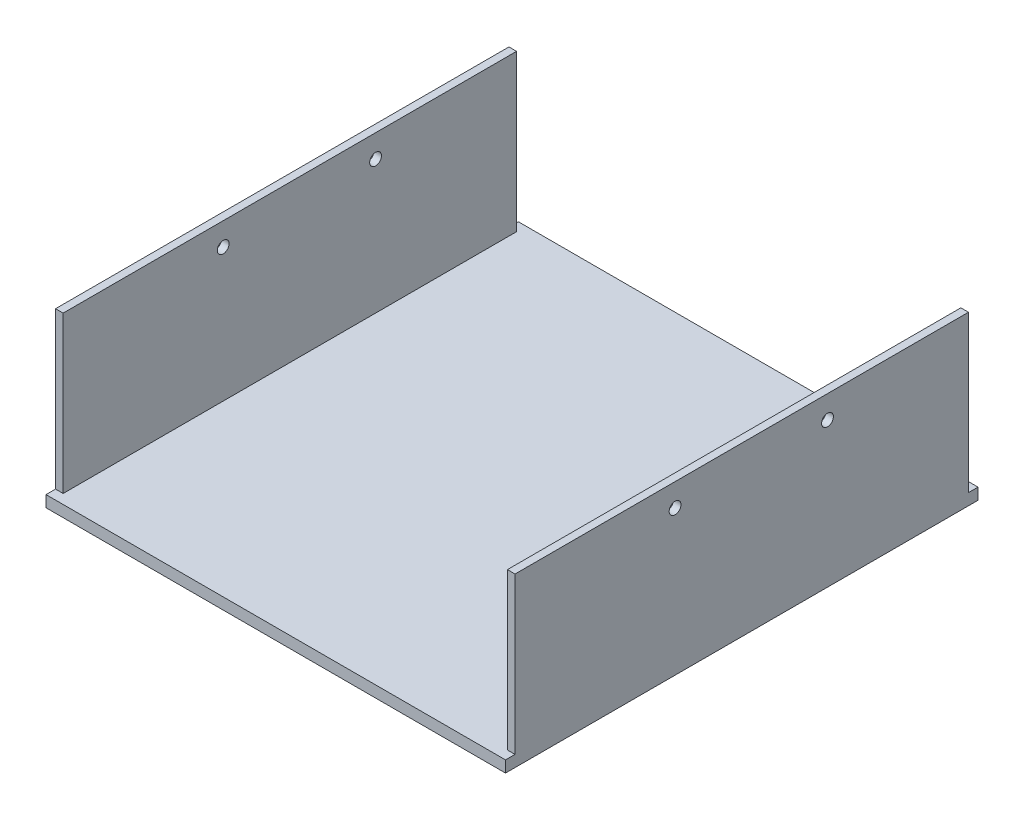
ISO-10303-21;
HEADER;
FILE_DESCRIPTION(('STEP AP214'),'2;1');
FILE_NAME('part.step','',(''),(''),'','','');
FILE_SCHEMA(('AUTOMOTIVE_DESIGN { 1 0 10303 214 1 1 1 1 }'));
ENDSEC;
DATA;
#1=APPLICATION_CONTEXT('core data for automotive mechanical design processes');
#2=APPLICATION_PROTOCOL_DEFINITION('international standard','automotive_design',2000,#1);
#3=PRODUCT_CONTEXT('',#1,'mechanical');
#4=PRODUCT('Part','Part','',(#3));
#5=PRODUCT_RELATED_PRODUCT_CATEGORY('part','',(#4));
#6=PRODUCT_DEFINITION_FORMATION('','',#4);
#7=PRODUCT_DEFINITION_CONTEXT('part definition',#1,'design');
#8=PRODUCT_DEFINITION('design','',#6,#7);
#9=PRODUCT_DEFINITION_SHAPE('','',#8);
#10=(LENGTH_UNIT() NAMED_UNIT(*) SI_UNIT(.MILLI.,.METRE.));
#11=(NAMED_UNIT(*) PLANE_ANGLE_UNIT() SI_UNIT($,.RADIAN.));
#12=(NAMED_UNIT(*) SI_UNIT($,.STERADIAN.) SOLID_ANGLE_UNIT());
#13=UNCERTAINTY_MEASURE_WITH_UNIT(LENGTH_MEASURE(1.E-05),#10,'distance_accuracy_value','');
#14=(GEOMETRIC_REPRESENTATION_CONTEXT(3) GLOBAL_UNCERTAINTY_ASSIGNED_CONTEXT((#13)) GLOBAL_UNIT_ASSIGNED_CONTEXT((#10,
#11,#12)) REPRESENTATION_CONTEXT('',''));
#15=CARTESIAN_POINT('',(0.,0.,0.));
#16=DIRECTION('',(0.,0.,1.));
#17=DIRECTION('',(1.,0.,0.));
#18=AXIS2_PLACEMENT_3D('',#15,#16,#17);
#19=CARTESIAN_POINT('',(0.,44.,0.));
#20=DIRECTION('',(0.,1.,0.));
#21=DIRECTION('',(0.,0.,1.));
#22=AXIS2_PLACEMENT_3D('',#19,#20,#21);
#23=PLANE('',#22);
#24=DIRECTION('',(0.,0.,1.));
#25=VECTOR('',#24,1.);
#26=CARTESIAN_POINT('',(-60.3,44.,-62.));
#27=LINE('',#26,#25);
#28=CARTESIAN_POINT('',(-60.3,44.,-59.5));
#29=VERTEX_POINT('',#28);
#30=CARTESIAN_POINT('',(-60.3,44.,59.5));
#31=VERTEX_POINT('',#30);
#32=EDGE_CURVE('E155',#29,#31,#27,.T.);
#33=ORIENTED_EDGE('',*,*,#32,.T.);
#34=DIRECTION('',(-1.,0.,0.));
#35=VECTOR('',#34,1.);
#36=CARTESIAN_POINT('',(-60.3,44.,59.5));
#37=LINE('',#36,#35);
#38=CARTESIAN_POINT('',(-58.3,44.,59.5));
#39=VERTEX_POINT('',#38);
#40=EDGE_CURVE('E149',#39,#31,#37,.T.);
#41=ORIENTED_EDGE('',*,*,#40,.F.);
#42=DIRECTION('',(0.,0.,1.));
#43=VECTOR('',#42,1.);
#44=CARTESIAN_POINT('',(-58.3,44.,-62.));
#45=LINE('',#44,#43);
#46=CARTESIAN_POINT('',(-58.3,44.,-59.5));
#47=VERTEX_POINT('',#46);
#48=EDGE_CURVE('E237',#47,#39,#45,.T.);
#49=ORIENTED_EDGE('',*,*,#48,.F.);
#50=DIRECTION('',(1.,0.,0.));
#51=VECTOR('',#50,1.);
#52=CARTESIAN_POINT('',(-60.3,44.,-59.5));
#53=LINE('',#52,#51);
#54=EDGE_CURVE('E217',#29,#47,#53,.T.);
#55=ORIENTED_EDGE('',*,*,#54,.F.);
#56=EDGE_LOOP('',(#33,#41,#49,#55));
#57=FACE_BOUND('',#56,.T.);
#58=ADVANCED_FACE('F38',(#57),#23,.T.);
#59=DIRECTION('',(0.,0.,-1.));
#60=VECTOR('',#59,1.);
#61=CARTESIAN_POINT('',(58.3,44.,62.));
#62=LINE('',#61,#60);
#63=CARTESIAN_POINT('',(58.3,44.,59.5));
#64=VERTEX_POINT('',#63);
#65=CARTESIAN_POINT('',(58.3,44.,-59.5));
#66=VERTEX_POINT('',#65);
#67=EDGE_CURVE('E148',#64,#66,#62,.T.);
#68=ORIENTED_EDGE('',*,*,#67,.F.);
#69=CARTESIAN_POINT('',(60.3,44.,59.5));
#70=VERTEX_POINT('',#69);
#71=EDGE_CURVE('E132',#70,#64,#37,.T.);
#72=ORIENTED_EDGE('',*,*,#71,.F.);
#73=DIRECTION('',(0.,0.,-1.));
#74=VECTOR('',#73,1.);
#75=CARTESIAN_POINT('',(60.3,44.,-62.));
#76=LINE('',#75,#74);
#77=CARTESIAN_POINT('',(60.3,44.,-59.5));
#78=VERTEX_POINT('',#77);
#79=EDGE_CURVE('E146',#70,#78,#76,.T.);
#80=ORIENTED_EDGE('',*,*,#79,.T.);
#81=EDGE_CURVE('E219',#66,#78,#53,.T.);
#82=ORIENTED_EDGE('',*,*,#81,.F.);
#83=EDGE_LOOP('',(#68,#72,#80,#82));
#84=FACE_BOUND('',#83,.T.);
#85=ADVANCED_FACE('F144',(#84),#23,.T.);
#86=CARTESIAN_POINT('',(60.3,44.,-62.));
#87=DIRECTION('',(-1.,0.,0.));
#88=DIRECTION('',(0.,0.,1.));
#89=AXIS2_PLACEMENT_3D('',#86,#87,#88);
#90=PLANE('',#89);
#91=CARTESIAN_POINT('',(60.3,38.,-22.5));
#92=DIRECTION('',(-1.,0.,0.));
#93=DIRECTION('',(0.,0.,1.));
#94=AXIS2_PLACEMENT_3D('',#91,#92,#93);
#95=CIRCLE('',#94,1.55);
#96=CARTESIAN_POINT('',(60.3,38.,-20.95));
#97=VERTEX_POINT('',#96);
#98=EDGE_CURVE('E182',#97,#97,#95,.T.);
#99=ORIENTED_EDGE('',*,*,#98,.T.);
#100=EDGE_LOOP('',(#99));
#101=FACE_BOUND('',#100,.T.);
#102=CARTESIAN_POINT('',(60.3,38.,17.5));
#103=DIRECTION('',(-1.,0.,0.));
#104=DIRECTION('',(0.,0.,1.));
#105=AXIS2_PLACEMENT_3D('',#102,#103,#104);
#106=CIRCLE('',#105,1.55);
#107=CARTESIAN_POINT('',(60.3,38.,19.05));
#108=VERTEX_POINT('',#107);
#109=EDGE_CURVE('E189',#108,#108,#106,.T.);
#110=ORIENTED_EDGE('',*,*,#109,.T.);
#111=EDGE_LOOP('',(#110));
#112=FACE_BOUND('',#111,.T.);
#113=DIRECTION('',(0.,-1.,0.));
#114=VECTOR('',#113,1.);
#115=CARTESIAN_POINT('',(60.3,44.,59.5));
#116=LINE('',#115,#114);
#117=CARTESIAN_POINT('',(60.3,3.,59.5));
#118=VERTEX_POINT('',#117);
#119=EDGE_CURVE('E129',#70,#118,#116,.T.);
#120=ORIENTED_EDGE('',*,*,#119,.T.);
#121=DIRECTION('',(0.,0.,-1.));
#122=VECTOR('',#121,1.);
#123=CARTESIAN_POINT('',(60.3,3.,59.5));
#124=LINE('',#123,#122);
#125=CARTESIAN_POINT('',(60.3,3.,62.));
#126=VERTEX_POINT('',#125);
#127=EDGE_CURVE('E206',#126,#118,#124,.T.);
#128=ORIENTED_EDGE('',*,*,#127,.F.);
#129=DIRECTION('',(0.,-1.,0.));
#130=VECTOR('',#129,1.);
#131=CARTESIAN_POINT('',(60.3,44.,62.));
#132=LINE('',#131,#130);
#133=CARTESIAN_POINT('',(60.3,0.,62.));
#134=VERTEX_POINT('',#133);
#135=EDGE_CURVE('E159',#126,#134,#132,.T.);
#136=ORIENTED_EDGE('',*,*,#135,.T.);
#137=DIRECTION('',(0.,0.,-1.));
#138=VECTOR('',#137,1.);
#139=CARTESIAN_POINT('',(60.3,0.,-62.));
#140=LINE('',#139,#138);
#141=CARTESIAN_POINT('',(60.3,0.,-62.));
#142=VERTEX_POINT('',#141);
#143=EDGE_CURVE('E168',#134,#142,#140,.T.);
#144=ORIENTED_EDGE('',*,*,#143,.T.);
#145=DIRECTION('',(0.,-1.,0.));
#146=VECTOR('',#145,1.);
#147=CARTESIAN_POINT('',(60.3,44.,-62.));
#148=LINE('',#147,#146);
#149=CARTESIAN_POINT('',(60.3,3.,-62.));
#150=VERTEX_POINT('',#149);
#151=EDGE_CURVE('E11',#150,#142,#148,.T.);
#152=ORIENTED_EDGE('',*,*,#151,.F.);
#153=DIRECTION('',(0.,0.,-1.));
#154=VECTOR('',#153,1.);
#155=CARTESIAN_POINT('',(60.3,3.,-59.5));
#156=LINE('',#155,#154);
#157=CARTESIAN_POINT('',(60.3,3.,-59.5));
#158=VERTEX_POINT('',#157);
#159=EDGE_CURVE('E223',#158,#150,#156,.T.);
#160=ORIENTED_EDGE('',*,*,#159,.F.);
#161=DIRECTION('',(0.,-1.,0.));
#162=VECTOR('',#161,1.);
#163=CARTESIAN_POINT('',(60.3,44.,-59.5));
#164=LINE('',#163,#162);
#165=EDGE_CURVE('E154',#78,#158,#164,.T.);
#166=ORIENTED_EDGE('',*,*,#165,.F.);
#167=ORIENTED_EDGE('',*,*,#79,.F.);
#168=EDGE_LOOP('',(#120,#128,#136,#144,#152,#160,#166,#167));
#169=FACE_BOUND('',#168,.T.);
#170=ADVANCED_FACE('F40',(#101,#112,#169),#90,.F.);
#171=CARTESIAN_POINT('',(-60.3,44.,-62.));
#172=DIRECTION('',(1.,0.,0.));
#173=DIRECTION('',(0.,0.,-1.));
#174=AXIS2_PLACEMENT_3D('',#171,#172,#173);
#175=PLANE('',#174);
#176=CARTESIAN_POINT('',(-60.3,38.,-22.5));
#177=DIRECTION('',(1.,0.,0.));
#178=DIRECTION('',(0.,0.,-1.));
#179=AXIS2_PLACEMENT_3D('',#176,#177,#178);
#180=CIRCLE('',#179,1.55);
#181=CARTESIAN_POINT('',(-60.3,38.,-24.05));
#182=VERTEX_POINT('',#181);
#183=EDGE_CURVE('E201',#182,#182,#180,.T.);
#184=ORIENTED_EDGE('',*,*,#183,.T.);
#185=EDGE_LOOP('',(#184));
#186=FACE_BOUND('',#185,.T.);
#187=CARTESIAN_POINT('',(-60.3,38.,17.5));
#188=DIRECTION('',(1.,0.,0.));
#189=DIRECTION('',(0.,0.,-1.));
#190=AXIS2_PLACEMENT_3D('',#187,#188,#189);
#191=CIRCLE('',#190,1.55);
#192=CARTESIAN_POINT('',(-60.3,38.,15.95));
#193=VERTEX_POINT('',#192);
#194=EDGE_CURVE('E186',#193,#193,#191,.T.);
#195=ORIENTED_EDGE('',*,*,#194,.T.);
#196=EDGE_LOOP('',(#195));
#197=FACE_BOUND('',#196,.T.);
#198=DIRECTION('',(0.,-1.,0.));
#199=VECTOR('',#198,1.);
#200=CARTESIAN_POINT('',(-60.3,44.,59.5));
#201=LINE('',#200,#199);
#202=CARTESIAN_POINT('',(-60.3,3.,59.5));
#203=VERTEX_POINT('',#202);
#204=EDGE_CURVE('E140',#31,#203,#201,.T.);
#205=ORIENTED_EDGE('',*,*,#204,.F.);
#206=ORIENTED_EDGE('',*,*,#32,.F.);
#207=DIRECTION('',(0.,-1.,0.));
#208=VECTOR('',#207,1.);
#209=CARTESIAN_POINT('',(-60.3,44.,-59.5));
#210=LINE('',#209,#208);
#211=CARTESIAN_POINT('',(-60.3,3.,-59.5));
#212=VERTEX_POINT('',#211);
#213=EDGE_CURVE('E227',#29,#212,#210,.T.);
#214=ORIENTED_EDGE('',*,*,#213,.T.);
#215=DIRECTION('',(0.,0.,1.));
#216=VECTOR('',#215,1.);
#217=CARTESIAN_POINT('',(-60.3,3.,-62.));
#218=LINE('',#217,#216);
#219=CARTESIAN_POINT('',(-60.3,3.,-62.));
#220=VERTEX_POINT('',#219);
#221=EDGE_CURVE('E216',#220,#212,#218,.T.);
#222=ORIENTED_EDGE('',*,*,#221,.F.);
#223=DIRECTION('',(0.,-1.,0.));
#224=VECTOR('',#223,1.);
#225=CARTESIAN_POINT('',(-60.3,44.,-62.));
#226=LINE('',#225,#224);
#227=CARTESIAN_POINT('',(-60.3,0.,-62.));
#228=VERTEX_POINT('',#227);
#229=EDGE_CURVE('E47',#220,#228,#226,.T.);
#230=ORIENTED_EDGE('',*,*,#229,.T.);
#231=DIRECTION('',(0.,0.,1.));
#232=VECTOR('',#231,1.);
#233=CARTESIAN_POINT('',(-60.3,0.,-62.));
#234=LINE('',#233,#232);
#235=CARTESIAN_POINT('',(-60.3,0.,62.));
#236=VERTEX_POINT('',#235);
#237=EDGE_CURVE('E162',#228,#236,#234,.T.);
#238=ORIENTED_EDGE('',*,*,#237,.T.);
#239=DIRECTION('',(0.,-1.,0.));
#240=VECTOR('',#239,1.);
#241=CARTESIAN_POINT('',(-60.3,44.,62.));
#242=LINE('',#241,#240);
#243=CARTESIAN_POINT('',(-60.3,3.,62.));
#244=VERTEX_POINT('',#243);
#245=EDGE_CURVE('E177',#244,#236,#242,.T.);
#246=ORIENTED_EDGE('',*,*,#245,.F.);
#247=DIRECTION('',(0.,0.,1.));
#248=VECTOR('',#247,1.);
#249=CARTESIAN_POINT('',(-60.3,3.,62.));
#250=LINE('',#249,#248);
#251=EDGE_CURVE('E203',#203,#244,#250,.T.);
#252=ORIENTED_EDGE('',*,*,#251,.F.);
#253=EDGE_LOOP('',(#205,#206,#214,#222,#230,#238,#246,#252));
#254=FACE_BOUND('',#253,.T.);
#255=ADVANCED_FACE('F263',(#186,#197,#254),#175,.F.);
#256=CARTESIAN_POINT('',(-58.3,44.,-62.));
#257=DIRECTION('',(1.,0.,0.));
#258=DIRECTION('',(0.,0.,-1.));
#259=AXIS2_PLACEMENT_3D('',#256,#257,#258);
#260=PLANE('',#259);
#261=CARTESIAN_POINT('',(-58.3,38.,-22.5));
#262=DIRECTION('',(1.,0.,0.));
#263=DIRECTION('',(0.,0.,-1.));
#264=AXIS2_PLACEMENT_3D('',#261,#262,#263);
#265=CIRCLE('',#264,1.55);
#266=CARTESIAN_POINT('',(-58.3,38.,-24.05));
#267=VERTEX_POINT('',#266);
#268=EDGE_CURVE('E198',#267,#267,#265,.T.);
#269=ORIENTED_EDGE('',*,*,#268,.F.);
#270=EDGE_LOOP('',(#269));
#271=FACE_BOUND('',#270,.T.);
#272=CARTESIAN_POINT('',(-58.3,38.,17.5));
#273=DIRECTION('',(1.,0.,0.));
#274=DIRECTION('',(0.,0.,-1.));
#275=AXIS2_PLACEMENT_3D('',#272,#273,#274);
#276=CIRCLE('',#275,1.55);
#277=CARTESIAN_POINT('',(-58.3,38.,15.95));
#278=VERTEX_POINT('',#277);
#279=EDGE_CURVE('E181',#278,#278,#276,.T.);
#280=ORIENTED_EDGE('',*,*,#279,.F.);
#281=EDGE_LOOP('',(#280));
#282=FACE_BOUND('',#281,.T.);
#283=ORIENTED_EDGE('',*,*,#48,.T.);
#284=DIRECTION('',(0.,-1.,0.));
#285=VECTOR('',#284,1.);
#286=CARTESIAN_POINT('',(-58.3,44.,59.5));
#287=LINE('',#286,#285);
#288=CARTESIAN_POINT('',(-58.3,3.,59.5));
#289=VERTEX_POINT('',#288);
#290=EDGE_CURVE('E213',#39,#289,#287,.T.);
#291=ORIENTED_EDGE('',*,*,#290,.T.);
#292=DIRECTION('',(0.,0.,1.));
#293=VECTOR('',#292,1.);
#294=CARTESIAN_POINT('',(-58.3,3.,-62.));
#295=LINE('',#294,#293);
#296=CARTESIAN_POINT('',(-58.3,3.,-59.5));
#297=VERTEX_POINT('',#296);
#298=EDGE_CURVE('E242',#297,#289,#295,.T.);
#299=ORIENTED_EDGE('',*,*,#298,.F.);
#300=DIRECTION('',(0.,1.,0.));
#301=VECTOR('',#300,1.);
#302=CARTESIAN_POINT('',(-58.3,44.,-59.5));
#303=LINE('',#302,#301);
#304=EDGE_CURVE('E233',#297,#47,#303,.T.);
#305=ORIENTED_EDGE('',*,*,#304,.T.);
#306=EDGE_LOOP('',(#283,#291,#299,#305));
#307=FACE_BOUND('',#306,.T.);
#308=ADVANCED_FACE('F253',(#271,#282,#307),#260,.T.);
#309=CARTESIAN_POINT('',(58.3,44.,62.));
#310=DIRECTION('',(-1.,0.,0.));
#311=DIRECTION('',(0.,0.,1.));
#312=AXIS2_PLACEMENT_3D('',#309,#310,#311);
#313=PLANE('',#312);
#314=CARTESIAN_POINT('',(58.3,38.,-22.5));
#315=DIRECTION('',(-1.,0.,0.));
#316=DIRECTION('',(0.,0.,1.));
#317=AXIS2_PLACEMENT_3D('',#314,#315,#316);
#318=CIRCLE('',#317,1.55);
#319=CARTESIAN_POINT('',(58.3,38.,-20.95));
#320=VERTEX_POINT('',#319);
#321=EDGE_CURVE('E42',#320,#320,#318,.T.);
#322=ORIENTED_EDGE('',*,*,#321,.F.);
#323=EDGE_LOOP('',(#322));
#324=FACE_BOUND('',#323,.T.);
#325=CARTESIAN_POINT('',(58.3,38.,17.5));
#326=DIRECTION('',(-1.,0.,0.));
#327=DIRECTION('',(0.,0.,1.));
#328=AXIS2_PLACEMENT_3D('',#325,#326,#327);
#329=CIRCLE('',#328,1.55);
#330=CARTESIAN_POINT('',(58.3,38.,19.05));
#331=VERTEX_POINT('',#330);
#332=EDGE_CURVE('E179',#331,#331,#329,.T.);
#333=ORIENTED_EDGE('',*,*,#332,.F.);
#334=EDGE_LOOP('',(#333));
#335=FACE_BOUND('',#334,.T.);
#336=DIRECTION('',(0.,0.,-1.));
#337=VECTOR('',#336,1.);
#338=CARTESIAN_POINT('',(58.3,3.,62.));
#339=LINE('',#338,#337);
#340=CARTESIAN_POINT('',(58.3,3.,59.5));
#341=VERTEX_POINT('',#340);
#342=CARTESIAN_POINT('',(58.3,3.,-59.5));
#343=VERTEX_POINT('',#342);
#344=EDGE_CURVE('E165',#341,#343,#339,.T.);
#345=ORIENTED_EDGE('',*,*,#344,.F.);
#346=DIRECTION('',(0.,1.,0.));
#347=VECTOR('',#346,1.);
#348=CARTESIAN_POINT('',(58.3,44.,59.5));
#349=LINE('',#348,#347);
#350=EDGE_CURVE('E139',#341,#64,#349,.T.);
#351=ORIENTED_EDGE('',*,*,#350,.T.);
#352=ORIENTED_EDGE('',*,*,#67,.T.);
#353=DIRECTION('',(0.,-1.,0.));
#354=VECTOR('',#353,1.);
#355=CARTESIAN_POINT('',(58.3,44.,-59.5));
#356=LINE('',#355,#354);
#357=EDGE_CURVE('E230',#66,#343,#356,.T.);
#358=ORIENTED_EDGE('',*,*,#357,.T.);
#359=EDGE_LOOP('',(#345,#351,#352,#358));
#360=FACE_BOUND('',#359,.T.);
#361=ADVANCED_FACE('F250',(#324,#335,#360),#313,.T.);
#362=CARTESIAN_POINT('',(-60.3,44.,-62.));
#363=DIRECTION('',(0.,0.,1.));
#364=DIRECTION('',(1.,0.,0.));
#365=AXIS2_PLACEMENT_3D('',#362,#363,#364);
#366=PLANE('',#365);
#367=DIRECTION('',(-1.,0.,0.));
#368=VECTOR('',#367,1.);
#369=CARTESIAN_POINT('',(58.3,3.,-62.));
#370=LINE('',#369,#368);
#371=EDGE_CURVE('E236',#150,#220,#370,.T.);
#372=ORIENTED_EDGE('',*,*,#371,.F.);
#373=ORIENTED_EDGE('',*,*,#151,.T.);
#374=DIRECTION('',(-1.,0.,0.));
#375=VECTOR('',#374,1.);
#376=CARTESIAN_POINT('',(-60.3,0.,-62.));
#377=LINE('',#376,#375);
#378=EDGE_CURVE('E171',#142,#228,#377,.T.);
#379=ORIENTED_EDGE('',*,*,#378,.T.);
#380=ORIENTED_EDGE('',*,*,#229,.F.);
#381=EDGE_LOOP('',(#372,#373,#379,#380));
#382=FACE_BOUND('',#381,.T.);
#383=ADVANCED_FACE('F252',(#382),#366,.F.);
#384=CARTESIAN_POINT('',(-60.3,44.,62.));
#385=DIRECTION('',(0.,0.,-1.));
#386=DIRECTION('',(-1.,0.,0.));
#387=AXIS2_PLACEMENT_3D('',#384,#385,#386);
#388=PLANE('',#387);
#389=ORIENTED_EDGE('',*,*,#135,.F.);
#390=DIRECTION('',(1.,0.,0.));
#391=VECTOR('',#390,1.);
#392=CARTESIAN_POINT('',(-58.3,3.,62.));
#393=LINE('',#392,#391);
#394=EDGE_CURVE('E55',#244,#126,#393,.T.);
#395=ORIENTED_EDGE('',*,*,#394,.F.);
#396=ORIENTED_EDGE('',*,*,#245,.T.);
#397=DIRECTION('',(1.,0.,0.));
#398=VECTOR('',#397,1.);
#399=CARTESIAN_POINT('',(-60.3,0.,62.));
#400=LINE('',#399,#398);
#401=EDGE_CURVE('E156',#236,#134,#400,.T.);
#402=ORIENTED_EDGE('',*,*,#401,.T.);
#403=EDGE_LOOP('',(#389,#395,#396,#402));
#404=FACE_BOUND('',#403,.T.);
#405=ADVANCED_FACE('F261',(#404),#388,.F.);
#406=CARTESIAN_POINT('',(0.,0.,0.));
#407=DIRECTION('',(0.,1.,0.));
#408=DIRECTION('',(0.,0.,1.));
#409=AXIS2_PLACEMENT_3D('',#406,#407,#408);
#410=PLANE('',#409);
#411=ORIENTED_EDGE('',*,*,#143,.F.);
#412=ORIENTED_EDGE('',*,*,#401,.F.);
#413=ORIENTED_EDGE('',*,*,#237,.F.);
#414=ORIENTED_EDGE('',*,*,#378,.F.);
#415=EDGE_LOOP('',(#411,#412,#413,#414));
#416=FACE_BOUND('',#415,.T.);
#417=ADVANCED_FACE('F276',(#416),#410,.F.);
#418=CARTESIAN_POINT('',(0.,3.,0.));
#419=DIRECTION('',(0.,1.,0.));
#420=DIRECTION('',(0.,0.,1.));
#421=AXIS2_PLACEMENT_3D('',#418,#419,#420);
#422=PLANE('',#421);
#423=ORIENTED_EDGE('',*,*,#394,.T.);
#424=ORIENTED_EDGE('',*,*,#127,.T.);
#425=DIRECTION('',(-1.,0.,0.));
#426=VECTOR('',#425,1.);
#427=CARTESIAN_POINT('',(-60.3,3.,59.5));
#428=LINE('',#427,#426);
#429=EDGE_CURVE('E135',#118,#341,#428,.T.);
#430=ORIENTED_EDGE('',*,*,#429,.T.);
#431=ORIENTED_EDGE('',*,*,#344,.T.);
#432=DIRECTION('',(1.,0.,0.));
#433=VECTOR('',#432,1.);
#434=CARTESIAN_POINT('',(-60.3,3.,-59.5));
#435=LINE('',#434,#433);
#436=EDGE_CURVE('E221',#343,#158,#435,.T.);
#437=ORIENTED_EDGE('',*,*,#436,.T.);
#438=ORIENTED_EDGE('',*,*,#159,.T.);
#439=ORIENTED_EDGE('',*,*,#371,.T.);
#440=ORIENTED_EDGE('',*,*,#221,.T.);
#441=EDGE_CURVE('E63',#212,#297,#435,.T.);
#442=ORIENTED_EDGE('',*,*,#441,.T.);
#443=ORIENTED_EDGE('',*,*,#298,.T.);
#444=EDGE_CURVE('E208',#289,#203,#428,.T.);
#445=ORIENTED_EDGE('',*,*,#444,.T.);
#446=ORIENTED_EDGE('',*,*,#251,.T.);
#447=EDGE_LOOP('',(#423,#424,#430,#431,#437,#438,#439,#440,#442,#443,#445,#446));
#448=FACE_BOUND('',#447,.T.);
#449=ADVANCED_FACE('F245',(#448),#422,.T.);
#450=CARTESIAN_POINT('',(-60.3,44.,-59.5));
#451=DIRECTION('',(0.,0.,-1.));
#452=DIRECTION('',(-1.,0.,0.));
#453=AXIS2_PLACEMENT_3D('',#450,#451,#452);
#454=PLANE('',#453);
#455=ORIENTED_EDGE('',*,*,#81,.T.);
#456=ORIENTED_EDGE('',*,*,#165,.T.);
#457=ORIENTED_EDGE('',*,*,#436,.F.);
#458=ORIENTED_EDGE('',*,*,#357,.F.);
#459=EDGE_LOOP('',(#455,#456,#457,#458));
#460=FACE_BOUND('',#459,.T.);
#461=ADVANCED_FACE('F249',(#460),#454,.T.);
#462=ORIENTED_EDGE('',*,*,#441,.F.);
#463=ORIENTED_EDGE('',*,*,#213,.F.);
#464=ORIENTED_EDGE('',*,*,#54,.T.);
#465=ORIENTED_EDGE('',*,*,#304,.F.);
#466=EDGE_LOOP('',(#462,#463,#464,#465));
#467=FACE_BOUND('',#466,.T.);
#468=ADVANCED_FACE('F300',(#467),#454,.T.);
#469=CARTESIAN_POINT('',(-60.3,44.,59.5));
#470=DIRECTION('',(0.,0.,1.));
#471=DIRECTION('',(1.,0.,0.));
#472=AXIS2_PLACEMENT_3D('',#469,#470,#471);
#473=PLANE('',#472);
#474=ORIENTED_EDGE('',*,*,#40,.T.);
#475=ORIENTED_EDGE('',*,*,#204,.T.);
#476=ORIENTED_EDGE('',*,*,#444,.F.);
#477=ORIENTED_EDGE('',*,*,#290,.F.);
#478=EDGE_LOOP('',(#474,#475,#476,#477));
#479=FACE_BOUND('',#478,.T.);
#480=ADVANCED_FACE('F303',(#479),#473,.T.);
#481=ORIENTED_EDGE('',*,*,#429,.F.);
#482=ORIENTED_EDGE('',*,*,#119,.F.);
#483=ORIENTED_EDGE('',*,*,#71,.T.);
#484=ORIENTED_EDGE('',*,*,#350,.F.);
#485=EDGE_LOOP('',(#481,#482,#483,#484));
#486=FACE_BOUND('',#485,.T.);
#487=ADVANCED_FACE('F131',(#486),#473,.T.);
#488=CARTESIAN_POINT('',(60.3,38.,17.5));
#489=DIRECTION('',(-1.,0.,0.));
#490=DIRECTION('',(0.,0.,1.));
#491=AXIS2_PLACEMENT_3D('',#488,#489,#490);
#492=CYLINDRICAL_SURFACE('',#491,1.55);
#493=ORIENTED_EDGE('',*,*,#332,.T.);
#494=EDGE_LOOP('',(#493));
#495=FACE_BOUND('',#494,.T.);
#496=ORIENTED_EDGE('',*,*,#109,.F.);
#497=EDGE_LOOP('',(#496));
#498=FACE_BOUND('',#497,.T.);
#499=ADVANCED_FACE('F310',(#495,#498),#492,.F.);
#500=CARTESIAN_POINT('',(60.3,38.,-22.5));
#501=DIRECTION('',(-1.,0.,0.));
#502=DIRECTION('',(0.,0.,1.));
#503=AXIS2_PLACEMENT_3D('',#500,#501,#502);
#504=CYLINDRICAL_SURFACE('',#503,1.55);
#505=ORIENTED_EDGE('',*,*,#321,.T.);
#506=EDGE_LOOP('',(#505));
#507=FACE_BOUND('',#506,.T.);
#508=ORIENTED_EDGE('',*,*,#98,.F.);
#509=EDGE_LOOP('',(#508));
#510=FACE_BOUND('',#509,.T.);
#511=ADVANCED_FACE('F431',(#507,#510),#504,.F.);
#512=ORIENTED_EDGE('',*,*,#279,.T.);
#513=EDGE_LOOP('',(#512));
#514=FACE_BOUND('',#513,.T.);
#515=ORIENTED_EDGE('',*,*,#194,.F.);
#516=EDGE_LOOP('',(#515));
#517=FACE_BOUND('',#516,.T.);
#518=ADVANCED_FACE('F432',(#514,#517),#492,.F.);
#519=ORIENTED_EDGE('',*,*,#268,.T.);
#520=EDGE_LOOP('',(#519));
#521=FACE_BOUND('',#520,.T.);
#522=ORIENTED_EDGE('',*,*,#183,.F.);
#523=EDGE_LOOP('',(#522));
#524=FACE_BOUND('',#523,.T.);
#525=ADVANCED_FACE('F440',(#521,#524),#504,.F.);
#526=CLOSED_SHELL('',(#58,#85,#170,#255,#308,#361,#383,#405,#417,#449,#461,#468,#480,#487,#499,
#511,#518,#525));
#527=MANIFOLD_SOLID_BREP('B2',#526);
#528=ADVANCED_BREP_SHAPE_REPRESENTATION('',(#18,#527),#14);
#529=SHAPE_DEFINITION_REPRESENTATION(#9,#528);
ENDSEC;
END-ISO-10303-21;
